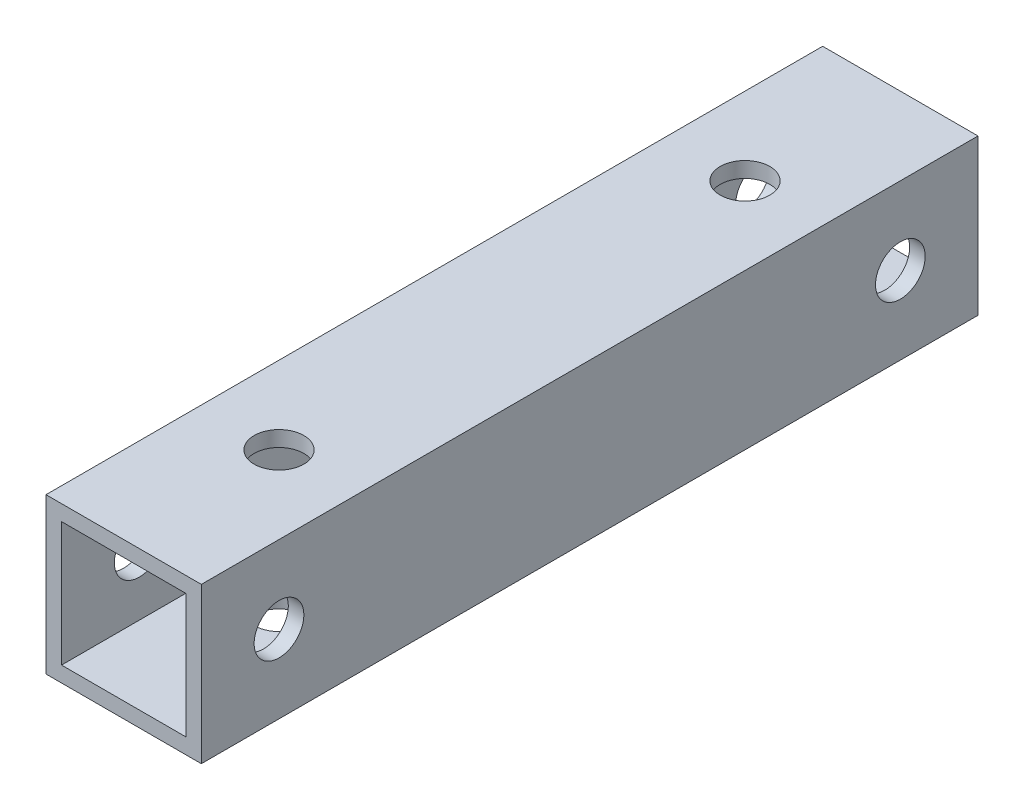
ISO-10303-21;
HEADER;
FILE_DESCRIPTION(('STEP AP214'),'2;1');
FILE_NAME('part.step','',(''),(''),'','','');
FILE_SCHEMA(('AUTOMOTIVE_DESIGN { 1 0 10303 214 1 1 1 1 }'));
ENDSEC;
DATA;
#1=APPLICATION_CONTEXT('core data for automotive mechanical design processes');
#2=APPLICATION_PROTOCOL_DEFINITION('international standard','automotive_design',2000,#1);
#3=PRODUCT_CONTEXT('',#1,'mechanical');
#4=PRODUCT('Part','Part','',(#3));
#5=PRODUCT_RELATED_PRODUCT_CATEGORY('part','',(#4));
#6=PRODUCT_DEFINITION_FORMATION('','',#4);
#7=PRODUCT_DEFINITION_CONTEXT('part definition',#1,'design');
#8=PRODUCT_DEFINITION('design','',#6,#7);
#9=PRODUCT_DEFINITION_SHAPE('','',#8);
#10=(LENGTH_UNIT() NAMED_UNIT(*) SI_UNIT(.MILLI.,.METRE.));
#11=(NAMED_UNIT(*) PLANE_ANGLE_UNIT() SI_UNIT($,.RADIAN.));
#12=(NAMED_UNIT(*) SI_UNIT($,.STERADIAN.) SOLID_ANGLE_UNIT());
#13=UNCERTAINTY_MEASURE_WITH_UNIT(LENGTH_MEASURE(1.E-05),#10,'distance_accuracy_value','');
#14=(GEOMETRIC_REPRESENTATION_CONTEXT(3) GLOBAL_UNCERTAINTY_ASSIGNED_CONTEXT((#13)) GLOBAL_UNIT_ASSIGNED_CONTEXT((#10,
#11,#12)) REPRESENTATION_CONTEXT('',''));
#15=CARTESIAN_POINT('',(0.,0.,0.));
#16=DIRECTION('',(0.,0.,1.));
#17=DIRECTION('',(1.,0.,0.));
#18=AXIS2_PLACEMENT_3D('',#15,#16,#17);
#19=CARTESIAN_POINT('',(0.,0.,25.));
#20=DIRECTION('',(0.,0.,-1.));
#21=DIRECTION('',(-1.,0.,0.));
#22=AXIS2_PLACEMENT_3D('',#19,#20,#21);
#23=PLANE('',#22);
#24=DIRECTION('',(0.,1.,0.));
#25=VECTOR('',#24,1.);
#26=CARTESIAN_POINT('',(5.,-5.,25.));
#27=LINE('',#26,#25);
#28=CARTESIAN_POINT('',(5.,-5.,25.));
#29=VERTEX_POINT('',#28);
#30=CARTESIAN_POINT('',(5.,5.,25.));
#31=VERTEX_POINT('',#30);
#32=EDGE_CURVE('E138',#29,#31,#27,.T.);
#33=ORIENTED_EDGE('',*,*,#32,.T.);
#34=DIRECTION('',(-1.,0.,0.));
#35=VECTOR('',#34,1.);
#36=CARTESIAN_POINT('',(-5.,5.,25.));
#37=LINE('',#36,#35);
#38=CARTESIAN_POINT('',(-5.,5.,25.));
#39=VERTEX_POINT('',#38);
#40=EDGE_CURVE('E141',#31,#39,#37,.T.);
#41=ORIENTED_EDGE('',*,*,#40,.T.);
#42=DIRECTION('',(0.,-1.,0.));
#43=VECTOR('',#42,1.);
#44=CARTESIAN_POINT('',(-5.,-5.,25.));
#45=LINE('',#44,#43);
#46=CARTESIAN_POINT('',(-5.,-5.,25.));
#47=VERTEX_POINT('',#46);
#48=EDGE_CURVE('E144',#39,#47,#45,.T.);
#49=ORIENTED_EDGE('',*,*,#48,.T.);
#50=DIRECTION('',(1.,0.,0.));
#51=VECTOR('',#50,1.);
#52=CARTESIAN_POINT('',(-5.,-5.,25.));
#53=LINE('',#52,#51);
#54=EDGE_CURVE('E146',#47,#29,#53,.T.);
#55=ORIENTED_EDGE('',*,*,#54,.T.);
#56=EDGE_LOOP('',(#33,#41,#49,#55));
#57=FACE_BOUND('',#56,.T.);
#58=DIRECTION('',(0.,1.,0.));
#59=VECTOR('',#58,1.);
#60=CARTESIAN_POINT('',(4.,-4.,25.));
#61=LINE('',#60,#59);
#62=CARTESIAN_POINT('',(4.,-4.,25.));
#63=VERTEX_POINT('',#62);
#64=CARTESIAN_POINT('',(4.,4.,25.));
#65=VERTEX_POINT('',#64);
#66=EDGE_CURVE('E100',#63,#65,#61,.T.);
#67=ORIENTED_EDGE('',*,*,#66,.F.);
#68=DIRECTION('',(1.,0.,0.));
#69=VECTOR('',#68,1.);
#70=CARTESIAN_POINT('',(-4.,-4.,25.));
#71=LINE('',#70,#69);
#72=CARTESIAN_POINT('',(-4.,-4.,25.));
#73=VERTEX_POINT('',#72);
#74=EDGE_CURVE('E122',#73,#63,#71,.T.);
#75=ORIENTED_EDGE('',*,*,#74,.F.);
#76=DIRECTION('',(0.,-1.,0.));
#77=VECTOR('',#76,1.);
#78=CARTESIAN_POINT('',(-4.,-4.,25.));
#79=LINE('',#78,#77);
#80=CARTESIAN_POINT('',(-4.,4.,25.));
#81=VERTEX_POINT('',#80);
#82=EDGE_CURVE('E120',#81,#73,#79,.T.);
#83=ORIENTED_EDGE('',*,*,#82,.F.);
#84=DIRECTION('',(-1.,0.,0.));
#85=VECTOR('',#84,1.);
#86=CARTESIAN_POINT('',(-4.,4.,25.));
#87=LINE('',#86,#85);
#88=EDGE_CURVE('E108',#65,#81,#87,.T.);
#89=ORIENTED_EDGE('',*,*,#88,.F.);
#90=EDGE_LOOP('',(#67,#75,#83,#89));
#91=FACE_BOUND('',#90,.T.);
#92=ADVANCED_FACE('F33',(#57,#91),#23,.F.);
#93=CARTESIAN_POINT('',(0.,0.,-25.));
#94=DIRECTION('',(0.,0.,-1.));
#95=DIRECTION('',(-1.,0.,0.));
#96=AXIS2_PLACEMENT_3D('',#93,#94,#95);
#97=PLANE('',#96);
#98=DIRECTION('',(0.,1.,0.));
#99=VECTOR('',#98,1.);
#100=CARTESIAN_POINT('',(5.,-5.,-25.));
#101=LINE('',#100,#99);
#102=CARTESIAN_POINT('',(5.,-5.,-25.));
#103=VERTEX_POINT('',#102);
#104=CARTESIAN_POINT('',(5.,5.,-25.));
#105=VERTEX_POINT('',#104);
#106=EDGE_CURVE('E116',#103,#105,#101,.T.);
#107=ORIENTED_EDGE('',*,*,#106,.F.);
#108=DIRECTION('',(1.,0.,0.));
#109=VECTOR('',#108,1.);
#110=CARTESIAN_POINT('',(-5.,-5.,-25.));
#111=LINE('',#110,#109);
#112=CARTESIAN_POINT('',(-5.,-5.,-25.));
#113=VERTEX_POINT('',#112);
#114=EDGE_CURVE('E142',#113,#103,#111,.T.);
#115=ORIENTED_EDGE('',*,*,#114,.F.);
#116=DIRECTION('',(0.,-1.,0.));
#117=VECTOR('',#116,1.);
#118=CARTESIAN_POINT('',(-5.,-5.,-25.));
#119=LINE('',#118,#117);
#120=CARTESIAN_POINT('',(-5.,5.,-25.));
#121=VERTEX_POINT('',#120);
#122=EDGE_CURVE('E153',#121,#113,#119,.T.);
#123=ORIENTED_EDGE('',*,*,#122,.F.);
#124=DIRECTION('',(-1.,0.,0.));
#125=VECTOR('',#124,1.);
#126=CARTESIAN_POINT('',(-5.,5.,-25.));
#127=LINE('',#126,#125);
#128=EDGE_CURVE('E151',#105,#121,#127,.T.);
#129=ORIENTED_EDGE('',*,*,#128,.F.);
#130=EDGE_LOOP('',(#107,#115,#123,#129));
#131=FACE_BOUND('',#130,.T.);
#132=DIRECTION('',(1.,0.,0.));
#133=VECTOR('',#132,1.);
#134=CARTESIAN_POINT('',(-4.,-4.,-25.));
#135=LINE('',#134,#133);
#136=CARTESIAN_POINT('',(-4.,-4.,-25.));
#137=VERTEX_POINT('',#136);
#138=CARTESIAN_POINT('',(4.,-4.,-25.));
#139=VERTEX_POINT('',#138);
#140=EDGE_CURVE('E109',#137,#139,#135,.T.);
#141=ORIENTED_EDGE('',*,*,#140,.T.);
#142=DIRECTION('',(0.,1.,0.));
#143=VECTOR('',#142,1.);
#144=CARTESIAN_POINT('',(4.,-4.,-25.));
#145=LINE('',#144,#143);
#146=CARTESIAN_POINT('',(4.,4.,-25.));
#147=VERTEX_POINT('',#146);
#148=EDGE_CURVE('E58',#139,#147,#145,.T.);
#149=ORIENTED_EDGE('',*,*,#148,.T.);
#150=DIRECTION('',(-1.,0.,0.));
#151=VECTOR('',#150,1.);
#152=CARTESIAN_POINT('',(-4.,4.,-25.));
#153=LINE('',#152,#151);
#154=CARTESIAN_POINT('',(-4.,4.,-25.));
#155=VERTEX_POINT('',#154);
#156=EDGE_CURVE('E115',#147,#155,#153,.T.);
#157=ORIENTED_EDGE('',*,*,#156,.T.);
#158=DIRECTION('',(0.,-1.,0.));
#159=VECTOR('',#158,1.);
#160=CARTESIAN_POINT('',(-4.,-4.,-25.));
#161=LINE('',#160,#159);
#162=EDGE_CURVE('E130',#155,#137,#161,.T.);
#163=ORIENTED_EDGE('',*,*,#162,.T.);
#164=EDGE_LOOP('',(#141,#149,#157,#163));
#165=FACE_BOUND('',#164,.T.);
#166=ADVANCED_FACE('F230',(#131,#165),#97,.T.);
#167=CARTESIAN_POINT('',(5.,-5.,25.));
#168=DIRECTION('',(-1.,0.,0.));
#169=DIRECTION('',(0.,0.,1.));
#170=AXIS2_PLACEMENT_3D('',#167,#168,#169);
#171=PLANE('',#170);
#172=CARTESIAN_POINT('',(5.,0.,20.));
#173=DIRECTION('',(1.,0.,0.));
#174=DIRECTION('',(0.,0.,-1.));
#175=AXIS2_PLACEMENT_3D('',#172,#173,#174);
#176=CIRCLE('',#175,1.6);
#177=CARTESIAN_POINT('',(5.,0.,18.4));
#178=VERTEX_POINT('',#177);
#179=EDGE_CURVE('E198',#178,#178,#176,.T.);
#180=ORIENTED_EDGE('',*,*,#179,.F.);
#181=EDGE_LOOP('',(#180));
#182=FACE_BOUND('',#181,.T.);
#183=CARTESIAN_POINT('',(5.,0.,-20.));
#184=DIRECTION('',(1.,0.,0.));
#185=DIRECTION('',(0.,0.,-1.));
#186=AXIS2_PLACEMENT_3D('',#183,#184,#185);
#187=CIRCLE('',#186,1.6);
#188=CARTESIAN_POINT('',(5.,0.,-21.6));
#189=VERTEX_POINT('',#188);
#190=EDGE_CURVE('E195',#189,#189,#187,.T.);
#191=ORIENTED_EDGE('',*,*,#190,.F.);
#192=EDGE_LOOP('',(#191));
#193=FACE_BOUND('',#192,.T.);
#194=ORIENTED_EDGE('',*,*,#106,.T.);
#195=DIRECTION('',(0.,0.,-1.));
#196=VECTOR('',#195,1.);
#197=CARTESIAN_POINT('',(5.,5.,25.));
#198=LINE('',#197,#196);
#199=EDGE_CURVE('E11',#31,#105,#198,.T.);
#200=ORIENTED_EDGE('',*,*,#199,.F.);
#201=ORIENTED_EDGE('',*,*,#32,.F.);
#202=DIRECTION('',(0.,0.,-1.));
#203=VECTOR('',#202,1.);
#204=CARTESIAN_POINT('',(5.,-5.,25.));
#205=LINE('',#204,#203);
#206=EDGE_CURVE('E148',#29,#103,#205,.T.);
#207=ORIENTED_EDGE('',*,*,#206,.T.);
#208=EDGE_LOOP('',(#194,#200,#201,#207));
#209=FACE_BOUND('',#208,.T.);
#210=ADVANCED_FACE('F35',(#182,#193,#209),#171,.F.);
#211=CARTESIAN_POINT('',(-5.,5.,25.));
#212=DIRECTION('',(0.,-1.,0.));
#213=DIRECTION('',(0.,0.,-1.));
#214=AXIS2_PLACEMENT_3D('',#211,#212,#213);
#215=PLANE('',#214);
#216=CARTESIAN_POINT('',(0.,5.,15.));
#217=DIRECTION('',(0.,1.,0.));
#218=DIRECTION('',(0.,0.,1.));
#219=AXIS2_PLACEMENT_3D('',#216,#217,#218);
#220=CIRCLE('',#219,1.6);
#221=CARTESIAN_POINT('',(0.,5.,16.6));
#222=VERTEX_POINT('',#221);
#223=EDGE_CURVE('E179',#222,#222,#220,.T.);
#224=ORIENTED_EDGE('',*,*,#223,.F.);
#225=EDGE_LOOP('',(#224));
#226=FACE_BOUND('',#225,.T.);
#227=CARTESIAN_POINT('',(0.,5.,-15.));
#228=DIRECTION('',(0.,1.,0.));
#229=DIRECTION('',(0.,0.,1.));
#230=AXIS2_PLACEMENT_3D('',#227,#228,#229);
#231=CIRCLE('',#230,1.6);
#232=CARTESIAN_POINT('',(0.,5.,-13.4));
#233=VERTEX_POINT('',#232);
#234=EDGE_CURVE('E189',#233,#233,#231,.T.);
#235=ORIENTED_EDGE('',*,*,#234,.F.);
#236=EDGE_LOOP('',(#235));
#237=FACE_BOUND('',#236,.T.);
#238=ORIENTED_EDGE('',*,*,#128,.T.);
#239=DIRECTION('',(0.,0.,-1.));
#240=VECTOR('',#239,1.);
#241=CARTESIAN_POINT('',(-5.,5.,25.));
#242=LINE('',#241,#240);
#243=EDGE_CURVE('E42',#39,#121,#242,.T.);
#244=ORIENTED_EDGE('',*,*,#243,.F.);
#245=ORIENTED_EDGE('',*,*,#40,.F.);
#246=ORIENTED_EDGE('',*,*,#199,.T.);
#247=EDGE_LOOP('',(#238,#244,#245,#246));
#248=FACE_BOUND('',#247,.T.);
#249=ADVANCED_FACE('F229',(#226,#237,#248),#215,.F.);
#250=CARTESIAN_POINT('',(-5.,-5.,25.));
#251=DIRECTION('',(1.,0.,0.));
#252=DIRECTION('',(0.,1.,0.));
#253=AXIS2_PLACEMENT_3D('',#250,#251,#252);
#254=PLANE('',#253);
#255=CARTESIAN_POINT('',(-5.,0.,20.));
#256=DIRECTION('',(1.,0.,0.));
#257=DIRECTION('',(0.,0.,-1.));
#258=AXIS2_PLACEMENT_3D('',#255,#256,#257);
#259=CIRCLE('',#258,1.6);
#260=CARTESIAN_POINT('',(-5.,0.,18.4));
#261=VERTEX_POINT('',#260);
#262=EDGE_CURVE('E167',#261,#261,#259,.T.);
#263=ORIENTED_EDGE('',*,*,#262,.T.);
#264=EDGE_LOOP('',(#263));
#265=FACE_BOUND('',#264,.T.);
#266=CARTESIAN_POINT('',(-5.,0.,-20.));
#267=DIRECTION('',(1.,0.,0.));
#268=DIRECTION('',(0.,0.,-1.));
#269=AXIS2_PLACEMENT_3D('',#266,#267,#268);
#270=CIRCLE('',#269,1.6);
#271=CARTESIAN_POINT('',(-5.,0.,-21.6));
#272=VERTEX_POINT('',#271);
#273=EDGE_CURVE('E201',#272,#272,#270,.T.);
#274=ORIENTED_EDGE('',*,*,#273,.T.);
#275=EDGE_LOOP('',(#274));
#276=FACE_BOUND('',#275,.T.);
#277=ORIENTED_EDGE('',*,*,#122,.T.);
#278=DIRECTION('',(0.,0.,-1.));
#279=VECTOR('',#278,1.);
#280=CARTESIAN_POINT('',(-5.,-5.,25.));
#281=LINE('',#280,#279);
#282=EDGE_CURVE('E158',#47,#113,#281,.T.);
#283=ORIENTED_EDGE('',*,*,#282,.F.);
#284=ORIENTED_EDGE('',*,*,#48,.F.);
#285=ORIENTED_EDGE('',*,*,#243,.T.);
#286=EDGE_LOOP('',(#277,#283,#284,#285));
#287=FACE_BOUND('',#286,.T.);
#288=ADVANCED_FACE('F248',(#265,#276,#287),#254,.F.);
#289=CARTESIAN_POINT('',(-5.,-5.,25.));
#290=DIRECTION('',(0.,1.,0.));
#291=DIRECTION('',(-1.,0.,0.));
#292=AXIS2_PLACEMENT_3D('',#289,#290,#291);
#293=PLANE('',#292);
#294=CARTESIAN_POINT('',(0.,-5.,15.));
#295=DIRECTION('',(0.,1.,0.));
#296=DIRECTION('',(0.,0.,1.));
#297=AXIS2_PLACEMENT_3D('',#294,#295,#296);
#298=CIRCLE('',#297,1.6);
#299=CARTESIAN_POINT('',(0.,-5.,16.6));
#300=VERTEX_POINT('',#299);
#301=EDGE_CURVE('E173',#300,#300,#298,.T.);
#302=ORIENTED_EDGE('',*,*,#301,.T.);
#303=EDGE_LOOP('',(#302));
#304=FACE_BOUND('',#303,.T.);
#305=CARTESIAN_POINT('',(0.,-5.,-15.));
#306=DIRECTION('',(0.,1.,0.));
#307=DIRECTION('',(0.,0.,1.));
#308=AXIS2_PLACEMENT_3D('',#305,#306,#307);
#309=CIRCLE('',#308,1.6);
#310=CARTESIAN_POINT('',(0.,-5.,-13.4));
#311=VERTEX_POINT('',#310);
#312=EDGE_CURVE('E184',#311,#311,#309,.T.);
#313=ORIENTED_EDGE('',*,*,#312,.T.);
#314=EDGE_LOOP('',(#313));
#315=FACE_BOUND('',#314,.T.);
#316=ORIENTED_EDGE('',*,*,#114,.T.);
#317=ORIENTED_EDGE('',*,*,#206,.F.);
#318=ORIENTED_EDGE('',*,*,#54,.F.);
#319=ORIENTED_EDGE('',*,*,#282,.T.);
#320=EDGE_LOOP('',(#316,#317,#318,#319));
#321=FACE_BOUND('',#320,.T.);
#322=ADVANCED_FACE('F215',(#304,#315,#321),#293,.F.);
#323=CARTESIAN_POINT('',(4.,-4.,25.));
#324=DIRECTION('',(-1.,0.,0.));
#325=DIRECTION('',(0.,0.,1.));
#326=AXIS2_PLACEMENT_3D('',#323,#324,#325);
#327=PLANE('',#326);
#328=CARTESIAN_POINT('',(4.,0.,20.));
#329=DIRECTION('',(-1.,0.,0.));
#330=DIRECTION('',(0.,0.,1.));
#331=AXIS2_PLACEMENT_3D('',#328,#329,#330);
#332=CIRCLE('',#331,1.6);
#333=CARTESIAN_POINT('',(4.,0.,21.6));
#334=VERTEX_POINT('',#333);
#335=EDGE_CURVE('E128',#334,#334,#332,.T.);
#336=ORIENTED_EDGE('',*,*,#335,.F.);
#337=EDGE_LOOP('',(#336));
#338=FACE_BOUND('',#337,.T.);
#339=CARTESIAN_POINT('',(4.,0.,-20.));
#340=DIRECTION('',(-1.,0.,0.));
#341=DIRECTION('',(0.,0.,1.));
#342=AXIS2_PLACEMENT_3D('',#339,#340,#341);
#343=CIRCLE('',#342,1.6);
#344=CARTESIAN_POINT('',(4.,0.,-18.4));
#345=VERTEX_POINT('',#344);
#346=EDGE_CURVE('E166',#345,#345,#343,.T.);
#347=ORIENTED_EDGE('',*,*,#346,.F.);
#348=EDGE_LOOP('',(#347));
#349=FACE_BOUND('',#348,.T.);
#350=ORIENTED_EDGE('',*,*,#148,.F.);
#351=DIRECTION('',(0.,0.,-1.));
#352=VECTOR('',#351,1.);
#353=CARTESIAN_POINT('',(4.,-4.,25.));
#354=LINE('',#353,#352);
#355=EDGE_CURVE('E104',#63,#139,#354,.T.);
#356=ORIENTED_EDGE('',*,*,#355,.F.);
#357=ORIENTED_EDGE('',*,*,#66,.T.);
#358=DIRECTION('',(0.,0.,-1.));
#359=VECTOR('',#358,1.);
#360=CARTESIAN_POINT('',(4.,4.,25.));
#361=LINE('',#360,#359);
#362=EDGE_CURVE('E103',#65,#147,#361,.T.);
#363=ORIENTED_EDGE('',*,*,#362,.T.);
#364=EDGE_LOOP('',(#350,#356,#357,#363));
#365=FACE_BOUND('',#364,.T.);
#366=ADVANCED_FACE('F102',(#338,#349,#365),#327,.T.);
#367=CARTESIAN_POINT('',(-4.,4.,25.));
#368=DIRECTION('',(0.,-1.,0.));
#369=DIRECTION('',(0.,0.,-1.));
#370=AXIS2_PLACEMENT_3D('',#367,#368,#369);
#371=PLANE('',#370);
#372=CARTESIAN_POINT('',(0.,4.,15.));
#373=DIRECTION('',(0.,-1.,0.));
#374=DIRECTION('',(0.,0.,-1.));
#375=AXIS2_PLACEMENT_3D('',#372,#373,#374);
#376=CIRCLE('',#375,1.6);
#377=CARTESIAN_POINT('',(0.,4.,13.4));
#378=VERTEX_POINT('',#377);
#379=EDGE_CURVE('E192',#378,#378,#376,.T.);
#380=ORIENTED_EDGE('',*,*,#379,.F.);
#381=EDGE_LOOP('',(#380));
#382=FACE_BOUND('',#381,.T.);
#383=CARTESIAN_POINT('',(0.,4.,-15.));
#384=DIRECTION('',(0.,-1.,0.));
#385=DIRECTION('',(0.,0.,-1.));
#386=AXIS2_PLACEMENT_3D('',#383,#384,#385);
#387=CIRCLE('',#386,1.6);
#388=CARTESIAN_POINT('',(0.,4.,-16.6));
#389=VERTEX_POINT('',#388);
#390=EDGE_CURVE('E172',#389,#389,#387,.T.);
#391=ORIENTED_EDGE('',*,*,#390,.F.);
#392=EDGE_LOOP('',(#391));
#393=FACE_BOUND('',#392,.T.);
#394=ORIENTED_EDGE('',*,*,#156,.F.);
#395=ORIENTED_EDGE('',*,*,#362,.F.);
#396=ORIENTED_EDGE('',*,*,#88,.T.);
#397=DIRECTION('',(0.,0.,-1.));
#398=VECTOR('',#397,1.);
#399=CARTESIAN_POINT('',(-4.,4.,25.));
#400=LINE('',#399,#398);
#401=EDGE_CURVE('E117',#81,#155,#400,.T.);
#402=ORIENTED_EDGE('',*,*,#401,.T.);
#403=EDGE_LOOP('',(#394,#395,#396,#402));
#404=FACE_BOUND('',#403,.T.);
#405=ADVANCED_FACE('F112',(#382,#393,#404),#371,.T.);
#406=CARTESIAN_POINT('',(-4.,-4.,25.));
#407=DIRECTION('',(1.,0.,0.));
#408=DIRECTION('',(0.,0.,-1.));
#409=AXIS2_PLACEMENT_3D('',#406,#407,#408);
#410=PLANE('',#409);
#411=CARTESIAN_POINT('',(-4.,0.,20.));
#412=DIRECTION('',(1.,0.,0.));
#413=DIRECTION('',(0.,0.,-1.));
#414=AXIS2_PLACEMENT_3D('',#411,#412,#413);
#415=CIRCLE('',#414,1.6);
#416=CARTESIAN_POINT('',(-4.,0.,18.4));
#417=VERTEX_POINT('',#416);
#418=EDGE_CURVE('E168',#417,#417,#415,.T.);
#419=ORIENTED_EDGE('',*,*,#418,.F.);
#420=EDGE_LOOP('',(#419));
#421=FACE_BOUND('',#420,.T.);
#422=CARTESIAN_POINT('',(-4.,0.,-20.));
#423=DIRECTION('',(1.,0.,0.));
#424=DIRECTION('',(0.,0.,-1.));
#425=AXIS2_PLACEMENT_3D('',#422,#423,#424);
#426=CIRCLE('',#425,1.6);
#427=CARTESIAN_POINT('',(-4.,0.,-21.6));
#428=VERTEX_POINT('',#427);
#429=EDGE_CURVE('E163',#428,#428,#426,.T.);
#430=ORIENTED_EDGE('',*,*,#429,.F.);
#431=EDGE_LOOP('',(#430));
#432=FACE_BOUND('',#431,.T.);
#433=ORIENTED_EDGE('',*,*,#162,.F.);
#434=ORIENTED_EDGE('',*,*,#401,.F.);
#435=ORIENTED_EDGE('',*,*,#82,.T.);
#436=DIRECTION('',(0.,0.,-1.));
#437=VECTOR('',#436,1.);
#438=CARTESIAN_POINT('',(-4.,-4.,25.));
#439=LINE('',#438,#437);
#440=EDGE_CURVE('E50',#73,#137,#439,.T.);
#441=ORIENTED_EDGE('',*,*,#440,.T.);
#442=EDGE_LOOP('',(#433,#434,#435,#441));
#443=FACE_BOUND('',#442,.T.);
#444=ADVANCED_FACE('F268',(#421,#432,#443),#410,.T.);
#445=CARTESIAN_POINT('',(-4.,-4.,25.));
#446=DIRECTION('',(0.,1.,0.));
#447=DIRECTION('',(0.,0.,1.));
#448=AXIS2_PLACEMENT_3D('',#445,#446,#447);
#449=PLANE('',#448);
#450=CARTESIAN_POINT('',(0.,-4.,15.));
#451=DIRECTION('',(0.,1.,0.));
#452=DIRECTION('',(0.,0.,1.));
#453=AXIS2_PLACEMENT_3D('',#450,#451,#452);
#454=CIRCLE('',#453,1.6);
#455=CARTESIAN_POINT('',(0.,-4.,16.6));
#456=VERTEX_POINT('',#455);
#457=EDGE_CURVE('E37',#456,#456,#454,.T.);
#458=ORIENTED_EDGE('',*,*,#457,.F.);
#459=EDGE_LOOP('',(#458));
#460=FACE_BOUND('',#459,.T.);
#461=CARTESIAN_POINT('',(0.,-4.,-15.));
#462=DIRECTION('',(0.,1.,0.));
#463=DIRECTION('',(0.,0.,1.));
#464=AXIS2_PLACEMENT_3D('',#461,#462,#463);
#465=CIRCLE('',#464,1.6);
#466=CARTESIAN_POINT('',(0.,-4.,-13.4));
#467=VERTEX_POINT('',#466);
#468=EDGE_CURVE('E170',#467,#467,#465,.T.);
#469=ORIENTED_EDGE('',*,*,#468,.F.);
#470=EDGE_LOOP('',(#469));
#471=FACE_BOUND('',#470,.T.);
#472=ORIENTED_EDGE('',*,*,#140,.F.);
#473=ORIENTED_EDGE('',*,*,#440,.F.);
#474=ORIENTED_EDGE('',*,*,#74,.T.);
#475=ORIENTED_EDGE('',*,*,#355,.T.);
#476=EDGE_LOOP('',(#472,#473,#474,#475));
#477=FACE_BOUND('',#476,.T.);
#478=ADVANCED_FACE('F272',(#460,#471,#477),#449,.T.);
#479=CARTESIAN_POINT('',(-5.,0.,-20.));
#480=DIRECTION('',(1.,0.,0.));
#481=DIRECTION('',(0.,0.,-1.));
#482=AXIS2_PLACEMENT_3D('',#479,#480,#481);
#483=CYLINDRICAL_SURFACE('',#482,1.6);
#484=ORIENTED_EDGE('',*,*,#429,.T.);
#485=EDGE_LOOP('',(#484));
#486=FACE_BOUND('',#485,.T.);
#487=ORIENTED_EDGE('',*,*,#273,.F.);
#488=EDGE_LOOP('',(#487));
#489=FACE_BOUND('',#488,.T.);
#490=ADVANCED_FACE('F224',(#486,#489),#483,.F.);
#491=CARTESIAN_POINT('',(-5.,0.,20.));
#492=DIRECTION('',(1.,0.,0.));
#493=DIRECTION('',(0.,0.,-1.));
#494=AXIS2_PLACEMENT_3D('',#491,#492,#493);
#495=CYLINDRICAL_SURFACE('',#494,1.6);
#496=ORIENTED_EDGE('',*,*,#418,.T.);
#497=EDGE_LOOP('',(#496));
#498=FACE_BOUND('',#497,.T.);
#499=ORIENTED_EDGE('',*,*,#262,.F.);
#500=EDGE_LOOP('',(#499));
#501=FACE_BOUND('',#500,.T.);
#502=ADVANCED_FACE('F222',(#498,#501),#495,.F.);
#503=ORIENTED_EDGE('',*,*,#346,.T.);
#504=EDGE_LOOP('',(#503));
#505=FACE_BOUND('',#504,.T.);
#506=ORIENTED_EDGE('',*,*,#190,.T.);
#507=EDGE_LOOP('',(#506));
#508=FACE_BOUND('',#507,.T.);
#509=ADVANCED_FACE('F219',(#505,#508),#483,.F.);
#510=ORIENTED_EDGE('',*,*,#335,.T.);
#511=EDGE_LOOP('',(#510));
#512=FACE_BOUND('',#511,.T.);
#513=ORIENTED_EDGE('',*,*,#179,.T.);
#514=EDGE_LOOP('',(#513));
#515=FACE_BOUND('',#514,.T.);
#516=ADVANCED_FACE('F210',(#512,#515),#495,.F.);
#517=CARTESIAN_POINT('',(0.,-5.,-15.));
#518=DIRECTION('',(0.,1.,0.));
#519=DIRECTION('',(0.,0.,1.));
#520=AXIS2_PLACEMENT_3D('',#517,#518,#519);
#521=CYLINDRICAL_SURFACE('',#520,1.6);
#522=ORIENTED_EDGE('',*,*,#468,.T.);
#523=EDGE_LOOP('',(#522));
#524=FACE_BOUND('',#523,.T.);
#525=ORIENTED_EDGE('',*,*,#312,.F.);
#526=EDGE_LOOP('',(#525));
#527=FACE_BOUND('',#526,.T.);
#528=ADVANCED_FACE('F282',(#524,#527),#521,.F.);
#529=CARTESIAN_POINT('',(0.,-5.,15.));
#530=DIRECTION('',(0.,1.,0.));
#531=DIRECTION('',(0.,0.,1.));
#532=AXIS2_PLACEMENT_3D('',#529,#530,#531);
#533=CYLINDRICAL_SURFACE('',#532,1.6);
#534=ORIENTED_EDGE('',*,*,#457,.T.);
#535=EDGE_LOOP('',(#534));
#536=FACE_BOUND('',#535,.T.);
#537=ORIENTED_EDGE('',*,*,#301,.F.);
#538=EDGE_LOOP('',(#537));
#539=FACE_BOUND('',#538,.T.);
#540=ADVANCED_FACE('F285',(#536,#539),#533,.F.);
#541=ORIENTED_EDGE('',*,*,#390,.T.);
#542=EDGE_LOOP('',(#541));
#543=FACE_BOUND('',#542,.T.);
#544=ORIENTED_EDGE('',*,*,#234,.T.);
#545=EDGE_LOOP('',(#544));
#546=FACE_BOUND('',#545,.T.);
#547=ADVANCED_FACE('F286',(#543,#546),#521,.F.);
#548=ORIENTED_EDGE('',*,*,#379,.T.);
#549=EDGE_LOOP('',(#548));
#550=FACE_BOUND('',#549,.T.);
#551=ORIENTED_EDGE('',*,*,#223,.T.);
#552=EDGE_LOOP('',(#551));
#553=FACE_BOUND('',#552,.T.);
#554=ADVANCED_FACE('F289',(#550,#553),#533,.F.);
#555=CLOSED_SHELL('',(#92,#166,#210,#249,#288,#322,#366,#405,#444,#478,#490,#502,#509,#516,#528,
#540,#547,#554));
#556=MANIFOLD_SOLID_BREP('B2',#555);
#557=ADVANCED_BREP_SHAPE_REPRESENTATION('',(#18,#556),#14);
#558=SHAPE_DEFINITION_REPRESENTATION(#9,#557);
ENDSEC;
END-ISO-10303-21;
